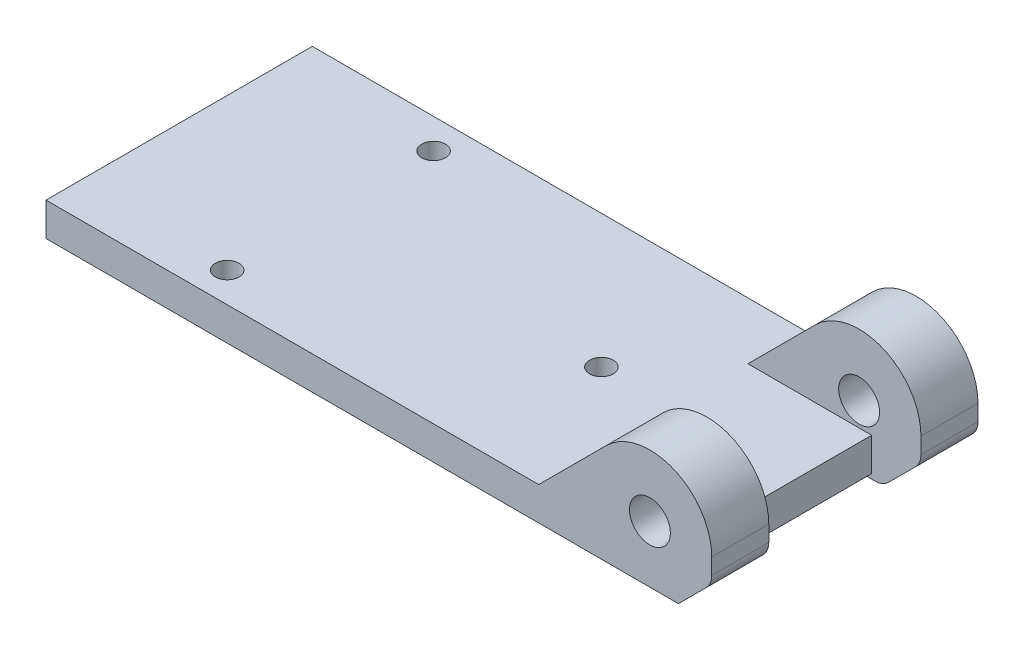
ISO-10303-21;
HEADER;
FILE_DESCRIPTION(('STEP AP214'),'2;1');
FILE_NAME('part.step','',(''),(''),'','','');
FILE_SCHEMA(('AUTOMOTIVE_DESIGN { 1 0 10303 214 1 1 1 1 }'));
ENDSEC;
DATA;
#1=APPLICATION_CONTEXT('core data for automotive mechanical design processes');
#2=APPLICATION_PROTOCOL_DEFINITION('international standard','automotive_design',2000,#1);
#3=PRODUCT_CONTEXT('',#1,'mechanical');
#4=PRODUCT('Part','Part','',(#3));
#5=PRODUCT_RELATED_PRODUCT_CATEGORY('part','',(#4));
#6=PRODUCT_DEFINITION_FORMATION('','',#4);
#7=PRODUCT_DEFINITION_CONTEXT('part definition',#1,'design');
#8=PRODUCT_DEFINITION('design','',#6,#7);
#9=PRODUCT_DEFINITION_SHAPE('','',#8);
#10=(LENGTH_UNIT() NAMED_UNIT(*) SI_UNIT(.MILLI.,.METRE.));
#11=(NAMED_UNIT(*) PLANE_ANGLE_UNIT() SI_UNIT($,.RADIAN.));
#12=(NAMED_UNIT(*) SI_UNIT($,.STERADIAN.) SOLID_ANGLE_UNIT());
#13=UNCERTAINTY_MEASURE_WITH_UNIT(LENGTH_MEASURE(1.E-05),#10,'distance_accuracy_value','');
#14=(GEOMETRIC_REPRESENTATION_CONTEXT(3) GLOBAL_UNCERTAINTY_ASSIGNED_CONTEXT((#13)) GLOBAL_UNIT_ASSIGNED_CONTEXT((#10,
#11,#12)) REPRESENTATION_CONTEXT('',''));
#15=CARTESIAN_POINT('',(0.,0.,0.));
#16=DIRECTION('',(0.,0.,1.));
#17=DIRECTION('',(1.,0.,0.));
#18=AXIS2_PLACEMENT_3D('',#15,#16,#17);
#19=CARTESIAN_POINT('',(35.,3.99999999999998,-14.));
#20=DIRECTION('',(0.707106781186546,-0.707106781186549,0.));
#21=DIRECTION('',(0.,0.,1.));
#22=AXIS2_PLACEMENT_3D('',#19,#20,#21);
#23=PLANE('',#22);
#24=DIRECTION('',(-0.707106781186549,-0.707106781186546,0.));
#25=VECTOR('',#24,1.);
#26=CARTESIAN_POINT('',(35.,3.99999999999998,8.));
#27=LINE('',#26,#25);
#28=CARTESIAN_POINT('',(34.4142135623731,3.41421356237307,8.));
#29=VERTEX_POINT('',#28);
#30=CARTESIAN_POINT('',(31.5857864376269,0.585786437626904,8.));
#31=VERTEX_POINT('',#30);
#32=EDGE_CURVE('E377',#29,#31,#27,.T.);
#33=ORIENTED_EDGE('',*,*,#32,.F.);
#34=DIRECTION('',(0.,0.,-1.));
#35=VECTOR('',#34,1.);
#36=CARTESIAN_POINT('',(34.4142135623731,3.41421356237307,14.));
#37=LINE('',#36,#35);
#38=CARTESIAN_POINT('',(34.4142135623731,3.41421356237307,14.));
#39=VERTEX_POINT('',#38);
#40=EDGE_CURVE('E300',#29,#39,#37,.F.);
#41=ORIENTED_EDGE('',*,*,#40,.T.);
#42=DIRECTION('',(0.707106781186549,0.707106781186546,0.));
#43=VECTOR('',#42,1.);
#44=CARTESIAN_POINT('',(35.,3.99999999999998,14.));
#45=LINE('',#44,#43);
#46=CARTESIAN_POINT('',(31.5857864376269,0.585786437626904,14.));
#47=VERTEX_POINT('',#46);
#48=EDGE_CURVE('E290',#47,#39,#45,.T.);
#49=ORIENTED_EDGE('',*,*,#48,.F.);
#50=DIRECTION('',(0.,0.,1.));
#51=VECTOR('',#50,1.);
#52=CARTESIAN_POINT('',(31.5857864376269,0.585786437626904,-14.));
#53=LINE('',#52,#51);
#54=EDGE_CURVE('E305',#47,#31,#53,.F.);
#55=ORIENTED_EDGE('',*,*,#54,.T.);
#56=EDGE_LOOP('',(#33,#41,#49,#55));
#57=FACE_BOUND('',#56,.T.);
#58=ADVANCED_FACE('F42',(#57),#23,.T.);
#59=CARTESIAN_POINT('',(30.1715728752538,2.,0.));
#60=DIRECTION('',(0.,0.,1.));
#61=DIRECTION('',(1.,0.,0.));
#62=AXIS2_PLACEMENT_3D('',#59,#60,#61);
#63=CYLINDRICAL_SURFACE('',#62,2.);
#64=CARTESIAN_POINT('',(30.1715728752538,2.,14.));
#65=DIRECTION('',(0.,0.,-1.));
#66=DIRECTION('',(-1.,0.,0.));
#67=AXIS2_PLACEMENT_3D('',#64,#65,#66);
#68=CIRCLE('',#67,2.);
#69=CARTESIAN_POINT('',(31.4944485307861,0.499999999999992,14.));
#70=VERTEX_POINT('',#69);
#71=EDGE_CURVE('E298',#70,#47,#68,.F.);
#72=ORIENTED_EDGE('',*,*,#71,.F.);
#73=CARTESIAN_POINT('',(30.1715728752538,2.,15.5));
#74=DIRECTION('',(0.,-0.707106781186552,0.707106781186543));
#75=DIRECTION('',(0.,0.707106781186543,0.707106781186552));
#76=AXIS2_PLACEMENT_3D('',#73,#74,#75);
#77=ELLIPSE('',#76,2.82842712474621,2.);
#78=CARTESIAN_POINT('',(30.1715728752538,0.,13.5));
#79=VERTEX_POINT('',#78);
#80=EDGE_CURVE('E340',#70,#79,#77,.F.);
#81=ORIENTED_EDGE('',*,*,#80,.T.);
#82=DIRECTION('',(0.,0.,1.));
#83=VECTOR('',#82,1.);
#84=CARTESIAN_POINT('',(30.1715728752538,0.,0.));
#85=LINE('',#84,#83);
#86=CARTESIAN_POINT('',(30.1715728752538,0.,8.));
#87=VERTEX_POINT('',#86);
#88=EDGE_CURVE('E293',#87,#79,#85,.T.);
#89=ORIENTED_EDGE('',*,*,#88,.F.);
#90=CARTESIAN_POINT('',(30.1715728752538,2.,8.));
#91=DIRECTION('',(0.,0.,1.));
#92=DIRECTION('',(1.,0.,0.));
#93=AXIS2_PLACEMENT_3D('',#90,#91,#92);
#94=CIRCLE('',#93,2.);
#95=EDGE_CURVE('E379',#31,#87,#94,.F.);
#96=ORIENTED_EDGE('',*,*,#95,.F.);
#97=ORIENTED_EDGE('',*,*,#54,.F.);
#98=EDGE_LOOP('',(#72,#81,#89,#96,#97));
#99=FACE_BOUND('',#98,.T.);
#100=ADVANCED_FACE('F405',(#99),#63,.T.);
#101=CARTESIAN_POINT('',(33.,4.82842712474617,-14.));
#102=DIRECTION('',(0.,0.,1.));
#103=DIRECTION('',(1.,0.,0.));
#104=AXIS2_PLACEMENT_3D('',#101,#102,#103);
#105=CYLINDRICAL_SURFACE('',#104,2.);
#106=ORIENTED_EDGE('',*,*,#40,.F.);
#107=CARTESIAN_POINT('',(33.,4.82842712474617,8.));
#108=DIRECTION('',(0.,0.,-1.));
#109=DIRECTION('',(-1.,0.,0.));
#110=AXIS2_PLACEMENT_3D('',#107,#108,#109);
#111=CIRCLE('',#110,2.);
#112=CARTESIAN_POINT('',(35.,4.82842712474617,8.));
#113=VERTEX_POINT('',#112);
#114=EDGE_CURVE('E321',#113,#29,#111,.T.);
#115=ORIENTED_EDGE('',*,*,#114,.F.);
#116=DIRECTION('',(0.,0.,-1.));
#117=VECTOR('',#116,1.);
#118=CARTESIAN_POINT('',(35.,4.82842712474617,8.));
#119=LINE('',#118,#117);
#120=CARTESIAN_POINT('',(35.,4.82842712474617,14.));
#121=VERTEX_POINT('',#120);
#122=EDGE_CURVE('E319',#121,#113,#119,.T.);
#123=ORIENTED_EDGE('',*,*,#122,.F.);
#124=CARTESIAN_POINT('',(33.,4.82842712474617,14.));
#125=DIRECTION('',(0.,0.,-1.));
#126=DIRECTION('',(-1.,0.,0.));
#127=AXIS2_PLACEMENT_3D('',#124,#125,#126);
#128=CIRCLE('',#127,2.);
#129=EDGE_CURVE('E296',#39,#121,#128,.F.);
#130=ORIENTED_EDGE('',*,*,#129,.F.);
#131=EDGE_LOOP('',(#106,#115,#123,#130));
#132=FACE_BOUND('',#131,.T.);
#133=ADVANCED_FACE('F410',(#132),#105,.T.);
#134=CARTESIAN_POINT('',(35.,4.,-14.));
#135=DIRECTION('',(-1.,0.,0.));
#136=DIRECTION('',(0.,0.,1.));
#137=AXIS2_PLACEMENT_3D('',#134,#135,#136);
#138=PLANE('',#137);
#139=DIRECTION('',(0.,-1.,0.));
#140=VECTOR('',#139,1.);
#141=CARTESIAN_POINT('',(35.,4.,14.));
#142=LINE('',#141,#140);
#143=CARTESIAN_POINT('',(35.,6.49999999999999,14.));
#144=VERTEX_POINT('',#143);
#145=EDGE_CURVE('E261',#144,#121,#142,.T.);
#146=ORIENTED_EDGE('',*,*,#145,.T.);
#147=ORIENTED_EDGE('',*,*,#122,.T.);
#148=DIRECTION('',(0.,1.,0.));
#149=VECTOR('',#148,1.);
#150=CARTESIAN_POINT('',(35.,13.,8.));
#151=LINE('',#150,#149);
#152=CARTESIAN_POINT('',(35.,6.5,8.));
#153=VERTEX_POINT('',#152);
#154=EDGE_CURVE('E240',#113,#153,#151,.T.);
#155=ORIENTED_EDGE('',*,*,#154,.T.);
#156=DIRECTION('',(0.,0.,-1.));
#157=VECTOR('',#156,1.);
#158=CARTESIAN_POINT('',(35.,6.50000000000002,14.));
#159=LINE('',#158,#157);
#160=EDGE_CURVE('E269',#153,#144,#159,.F.);
#161=ORIENTED_EDGE('',*,*,#160,.T.);
#162=EDGE_LOOP('',(#146,#147,#155,#161));
#163=FACE_BOUND('',#162,.T.);
#164=ADVANCED_FACE('F489',(#163),#138,.F.);
#165=CARTESIAN_POINT('',(28.5,6.50000000000002,-8.));
#166=DIRECTION('',(0.,0.,-1.));
#167=DIRECTION('',(-1.,0.,0.));
#168=AXIS2_PLACEMENT_3D('',#165,#166,#167);
#169=CYLINDRICAL_SURFACE('',#168,6.49999999999999);
#170=DIRECTION('',(0.,0.,-1.));
#171=VECTOR('',#170,1.);
#172=CARTESIAN_POINT('',(23.9038059222875,11.0961940777126,-8.));
#173=LINE('',#172,#171);
#174=CARTESIAN_POINT('',(23.9038059222875,11.0961940777126,-8.));
#175=VERTEX_POINT('',#174);
#176=CARTESIAN_POINT('',(23.9038059222875,11.0961940777126,-14.));
#177=VERTEX_POINT('',#176);
#178=EDGE_CURVE('E277',#175,#177,#173,.T.);
#179=ORIENTED_EDGE('',*,*,#178,.F.);
#180=CARTESIAN_POINT('',(28.5,6.50000000000002,-8.));
#181=DIRECTION('',(0.,0.,1.));
#182=DIRECTION('',(1.,0.,0.));
#183=AXIS2_PLACEMENT_3D('',#180,#181,#182);
#184=CIRCLE('',#183,6.49999999999999);
#185=CARTESIAN_POINT('',(35.,6.5,-8.));
#186=VERTEX_POINT('',#185);
#187=EDGE_CURVE('E283',#186,#175,#184,.T.);
#188=ORIENTED_EDGE('',*,*,#187,.F.);
#189=DIRECTION('',(0.,0.,-1.));
#190=VECTOR('',#189,1.);
#191=CARTESIAN_POINT('',(35.,6.50000000000002,-14.));
#192=LINE('',#191,#190);
#193=CARTESIAN_POINT('',(35.,6.49999999999999,-14.));
#194=VERTEX_POINT('',#193);
#195=EDGE_CURVE('E280',#194,#186,#192,.F.);
#196=ORIENTED_EDGE('',*,*,#195,.F.);
#197=CARTESIAN_POINT('',(28.5,6.50000000000002,-14.));
#198=DIRECTION('',(0.,0.,1.));
#199=DIRECTION('',(1.,0.,0.));
#200=AXIS2_PLACEMENT_3D('',#197,#198,#199);
#201=CIRCLE('',#200,6.49999999999999);
#202=EDGE_CURVE('E285',#177,#194,#201,.F.);
#203=ORIENTED_EDGE('',*,*,#202,.F.);
#204=EDGE_LOOP('',(#179,#188,#196,#203));
#205=FACE_BOUND('',#204,.T.);
#206=ADVANCED_FACE('F416',(#205),#169,.T.);
#207=CARTESIAN_POINT('',(28.5,6.50000000000002,14.));
#208=DIRECTION('',(0.,0.,1.));
#209=DIRECTION('',(1.,0.,0.));
#210=AXIS2_PLACEMENT_3D('',#207,#208,#209);
#211=CYLINDRICAL_SURFACE('',#210,6.49999999999999);
#212=DIRECTION('',(0.,0.,1.));
#213=VECTOR('',#212,1.);
#214=CARTESIAN_POINT('',(23.9038059222875,11.0961940777126,8.));
#215=LINE('',#214,#213);
#216=CARTESIAN_POINT('',(23.9038059222875,11.0961940777126,14.));
#217=VERTEX_POINT('',#216);
#218=CARTESIAN_POINT('',(23.9038059222875,11.0961940777126,8.));
#219=VERTEX_POINT('',#218);
#220=EDGE_CURVE('E266',#217,#219,#215,.F.);
#221=ORIENTED_EDGE('',*,*,#220,.F.);
#222=CARTESIAN_POINT('',(28.5,6.50000000000002,14.));
#223=DIRECTION('',(0.,0.,-1.));
#224=DIRECTION('',(-1.,0.,0.));
#225=AXIS2_PLACEMENT_3D('',#222,#223,#224);
#226=CIRCLE('',#225,6.49999999999999);
#227=EDGE_CURVE('E272',#144,#217,#226,.F.);
#228=ORIENTED_EDGE('',*,*,#227,.F.);
#229=ORIENTED_EDGE('',*,*,#160,.F.);
#230=CARTESIAN_POINT('',(28.5,6.50000000000002,8.));
#231=DIRECTION('',(0.,0.,-1.));
#232=DIRECTION('',(-1.,0.,0.));
#233=AXIS2_PLACEMENT_3D('',#230,#231,#232);
#234=CIRCLE('',#233,6.49999999999999);
#235=EDGE_CURVE('E274',#219,#153,#234,.T.);
#236=ORIENTED_EDGE('',*,*,#235,.F.);
#237=EDGE_LOOP('',(#221,#228,#229,#236));
#238=FACE_BOUND('',#237,.T.);
#239=ADVANCED_FACE('F486',(#238),#211,.T.);
#240=CARTESIAN_POINT('',(0.,4.,0.));
#241=DIRECTION('',(0.,-1.,0.));
#242=DIRECTION('',(0.,0.,-1.));
#243=AXIS2_PLACEMENT_3D('',#240,#241,#242);
#244=PLANE('',#243);
#245=CARTESIAN_POINT('',(9.40000000000002,4.,0.));
#246=DIRECTION('',(0.,1.,0.));
#247=DIRECTION('',(0.,0.,1.));
#248=AXIS2_PLACEMENT_3D('',#245,#246,#247);
#249=CIRCLE('',#248,1.25);
#250=CARTESIAN_POINT('',(9.40000000000002,4.,1.25));
#251=VERTEX_POINT('',#250);
#252=EDGE_CURVE('E367',#251,#251,#249,.T.);
#253=ORIENTED_EDGE('',*,*,#252,.F.);
#254=EDGE_LOOP('',(#253));
#255=FACE_BOUND('',#254,.T.);
#256=CARTESIAN_POINT('',(-19.1,4.,-10.8499999999998));
#257=DIRECTION('',(0.,1.,0.));
#258=DIRECTION('',(0.,0.,1.));
#259=AXIS2_PLACEMENT_3D('',#256,#257,#258);
#260=CIRCLE('',#259,1.25);
#261=CARTESIAN_POINT('',(-19.1,4.,-9.59999999999983));
#262=VERTEX_POINT('',#261);
#263=EDGE_CURVE('E353',#262,#262,#260,.T.);
#264=ORIENTED_EDGE('',*,*,#263,.F.);
#265=EDGE_LOOP('',(#264));
#266=FACE_BOUND('',#265,.T.);
#267=CARTESIAN_POINT('',(-19.1,4.,10.8499999999998));
#268=DIRECTION('',(0.,1.,0.));
#269=DIRECTION('',(0.,0.,1.));
#270=AXIS2_PLACEMENT_3D('',#267,#268,#269);
#271=CIRCLE('',#270,1.25);
#272=CARTESIAN_POINT('',(-19.1,4.,12.0999999999998));
#273=VERTEX_POINT('',#272);
#274=EDGE_CURVE('E213',#273,#273,#271,.T.);
#275=ORIENTED_EDGE('',*,*,#274,.F.);
#276=EDGE_LOOP('',(#275));
#277=FACE_BOUND('',#276,.T.);
#278=DIRECTION('',(1.,0.,0.));
#279=VECTOR('',#278,1.);
#280=CARTESIAN_POINT('',(16.8076118445749,4.,8.));
#281=LINE('',#280,#279);
#282=CARTESIAN_POINT('',(16.8076118445749,4.,8.));
#283=VERTEX_POINT('',#282);
#284=CARTESIAN_POINT('',(29.8203594422489,4.,8.));
#285=VERTEX_POINT('',#284);
#286=EDGE_CURVE('E211',#283,#285,#281,.T.);
#287=ORIENTED_EDGE('',*,*,#286,.T.);
#288=DIRECTION('',(0.,0.,1.));
#289=VECTOR('',#288,1.);
#290=CARTESIAN_POINT('',(29.8203594422489,4.,8.));
#291=LINE('',#290,#289);
#292=CARTESIAN_POINT('',(29.8203594422489,4.,-8.));
#293=VERTEX_POINT('',#292);
#294=EDGE_CURVE('E193',#293,#285,#291,.T.);
#295=ORIENTED_EDGE('',*,*,#294,.F.);
#296=DIRECTION('',(1.,0.,0.));
#297=VECTOR('',#296,1.);
#298=CARTESIAN_POINT('',(16.8076118445749,4.,-8.));
#299=LINE('',#298,#297);
#300=CARTESIAN_POINT('',(16.8076118445749,4.,-8.));
#301=VERTEX_POINT('',#300);
#302=EDGE_CURVE('E207',#301,#293,#299,.T.);
#303=ORIENTED_EDGE('',*,*,#302,.F.);
#304=DIRECTION('',(0.,0.,-1.));
#305=VECTOR('',#304,1.);
#306=CARTESIAN_POINT('',(16.8076118445749,4.,-8.));
#307=LINE('',#306,#305);
#308=CARTESIAN_POINT('',(16.8076118445749,4.,-14.));
#309=VERTEX_POINT('',#308);
#310=EDGE_CURVE('E229',#301,#309,#307,.T.);
#311=ORIENTED_EDGE('',*,*,#310,.T.);
#312=DIRECTION('',(-1.,0.,0.));
#313=VECTOR('',#312,1.);
#314=CARTESIAN_POINT('',(35.,4.,-14.));
#315=LINE('',#314,#313);
#316=CARTESIAN_POINT('',(-35.,4.,-14.));
#317=VERTEX_POINT('',#316);
#318=EDGE_CURVE('E254',#309,#317,#315,.T.);
#319=ORIENTED_EDGE('',*,*,#318,.T.);
#320=DIRECTION('',(0.,0.,1.));
#321=VECTOR('',#320,1.);
#322=CARTESIAN_POINT('',(-35.,4.,-14.));
#323=LINE('',#322,#321);
#324=CARTESIAN_POINT('',(-35.,4.,14.));
#325=VERTEX_POINT('',#324);
#326=EDGE_CURVE('E248',#317,#325,#323,.T.);
#327=ORIENTED_EDGE('',*,*,#326,.T.);
#328=DIRECTION('',(1.,0.,0.));
#329=VECTOR('',#328,1.);
#330=CARTESIAN_POINT('',(35.,4.,14.));
#331=LINE('',#330,#329);
#332=CARTESIAN_POINT('',(16.8076118445749,4.,14.));
#333=VERTEX_POINT('',#332);
#334=EDGE_CURVE('E251',#325,#333,#331,.T.);
#335=ORIENTED_EDGE('',*,*,#334,.T.);
#336=DIRECTION('',(0.,0.,1.));
#337=VECTOR('',#336,1.);
#338=CARTESIAN_POINT('',(16.8076118445749,4.,8.));
#339=LINE('',#338,#337);
#340=EDGE_CURVE('E244',#283,#333,#339,.T.);
#341=ORIENTED_EDGE('',*,*,#340,.F.);
#342=EDGE_LOOP('',(#287,#295,#303,#311,#319,#327,#335,#341));
#343=FACE_BOUND('',#342,.T.);
#344=ADVANCED_FACE('F205',(#255,#266,#277,#343),#244,.F.);
#345=CARTESIAN_POINT('',(-35.,4.,-14.));
#346=DIRECTION('',(1.,0.,0.));
#347=DIRECTION('',(0.,0.,-1.));
#348=AXIS2_PLACEMENT_3D('',#345,#346,#347);
#349=PLANE('',#348);
#350=DIRECTION('',(0.,-1.,0.));
#351=VECTOR('',#350,1.);
#352=CARTESIAN_POINT('',(-35.,4.,-14.));
#353=LINE('',#352,#351);
#354=CARTESIAN_POINT('',(-35.,0.499999999999994,-14.));
#355=VERTEX_POINT('',#354);
#356=EDGE_CURVE('E256',#317,#355,#353,.T.);
#357=ORIENTED_EDGE('',*,*,#356,.T.);
#358=DIRECTION('',(0.,0.,1.));
#359=VECTOR('',#358,1.);
#360=CARTESIAN_POINT('',(-35.,0.499999999999994,14.));
#361=LINE('',#360,#359);
#362=CARTESIAN_POINT('',(-35.,0.499999999999994,14.));
#363=VERTEX_POINT('',#362);
#364=EDGE_CURVE('E67',#355,#363,#361,.T.);
#365=ORIENTED_EDGE('',*,*,#364,.T.);
#366=DIRECTION('',(0.,-1.,0.));
#367=VECTOR('',#366,1.);
#368=CARTESIAN_POINT('',(-35.,4.,14.));
#369=LINE('',#368,#367);
#370=EDGE_CURVE('E264',#325,#363,#369,.T.);
#371=ORIENTED_EDGE('',*,*,#370,.F.);
#372=ORIENTED_EDGE('',*,*,#326,.F.);
#373=EDGE_LOOP('',(#357,#365,#371,#372));
#374=FACE_BOUND('',#373,.T.);
#375=ADVANCED_FACE('F475',(#374),#349,.F.);
#376=CARTESIAN_POINT('',(35.,4.,14.));
#377=DIRECTION('',(0.,0.,-1.));
#378=DIRECTION('',(-1.,0.,0.));
#379=AXIS2_PLACEMENT_3D('',#376,#377,#378);
#380=PLANE('',#379);
#381=ORIENTED_EDGE('',*,*,#370,.T.);
#382=DIRECTION('',(1.,0.,0.));
#383=VECTOR('',#382,1.);
#384=CARTESIAN_POINT('',(30.1715728752538,0.499999999999994,14.));
#385=LINE('',#384,#383);
#386=EDGE_CURVE('E59',#363,#70,#385,.T.);
#387=ORIENTED_EDGE('',*,*,#386,.T.);
#388=ORIENTED_EDGE('',*,*,#71,.T.);
#389=ORIENTED_EDGE('',*,*,#48,.T.);
#390=ORIENTED_EDGE('',*,*,#129,.T.);
#391=ORIENTED_EDGE('',*,*,#145,.F.);
#392=ORIENTED_EDGE('',*,*,#227,.T.);
#393=DIRECTION('',(-0.707106781186546,-0.707106781186549,0.));
#394=VECTOR('',#393,1.);
#395=CARTESIAN_POINT('',(16.8076118445749,4.,14.));
#396=LINE('',#395,#394);
#397=EDGE_CURVE('E236',#217,#333,#396,.T.);
#398=ORIENTED_EDGE('',*,*,#397,.T.);
#399=ORIENTED_EDGE('',*,*,#334,.F.);
#400=EDGE_LOOP('',(#381,#387,#388,#389,#390,#391,#392,#398,#399));
#401=FACE_BOUND('',#400,.T.);
#402=CARTESIAN_POINT('',(28.5,6.5,14.));
#403=DIRECTION('',(0.,0.,1.));
#404=DIRECTION('',(1.,0.,0.));
#405=AXIS2_PLACEMENT_3D('',#402,#403,#404);
#406=CIRCLE('',#405,2.15);
#407=CARTESIAN_POINT('',(30.65,6.5,14.));
#408=VERTEX_POINT('',#407);
#409=EDGE_CURVE('E232',#408,#408,#406,.T.);
#410=ORIENTED_EDGE('',*,*,#409,.F.);
#411=EDGE_LOOP('',(#410));
#412=FACE_BOUND('',#411,.T.);
#413=ADVANCED_FACE('F476',(#401,#412),#380,.F.);
#414=DIRECTION('',(0.,1.,0.));
#415=VECTOR('',#414,1.);
#416=CARTESIAN_POINT('',(35.,13.,-8.));
#417=LINE('',#416,#415);
#418=CARTESIAN_POINT('',(35.,4.82842712474617,-8.));
#419=VERTEX_POINT('',#418);
#420=EDGE_CURVE('E221',#419,#186,#417,.T.);
#421=ORIENTED_EDGE('',*,*,#420,.F.);
#422=DIRECTION('',(0.,0.,-1.));
#423=VECTOR('',#422,1.);
#424=CARTESIAN_POINT('',(35.,4.82842712474617,-14.));
#425=LINE('',#424,#423);
#426=CARTESIAN_POINT('',(35.,4.82842712474617,-14.));
#427=VERTEX_POINT('',#426);
#428=EDGE_CURVE('E314',#419,#427,#425,.T.);
#429=ORIENTED_EDGE('',*,*,#428,.T.);
#430=DIRECTION('',(0.,-1.,0.));
#431=VECTOR('',#430,1.);
#432=CARTESIAN_POINT('',(35.,4.,-14.));
#433=LINE('',#432,#431);
#434=EDGE_CURVE('E258',#194,#427,#433,.T.);
#435=ORIENTED_EDGE('',*,*,#434,.F.);
#436=ORIENTED_EDGE('',*,*,#195,.T.);
#437=EDGE_LOOP('',(#421,#429,#435,#436));
#438=FACE_BOUND('',#437,.T.);
#439=ADVANCED_FACE('F466',(#438),#138,.F.);
#440=CARTESIAN_POINT('',(35.,4.,-14.));
#441=DIRECTION('',(0.,0.,1.));
#442=DIRECTION('',(1.,0.,0.));
#443=AXIS2_PLACEMENT_3D('',#440,#441,#442);
#444=PLANE('',#443);
#445=CARTESIAN_POINT('',(30.1715728752538,2.,-14.));
#446=DIRECTION('',(0.,0.,1.));
#447=DIRECTION('',(1.,0.,0.));
#448=AXIS2_PLACEMENT_3D('',#445,#446,#447);
#449=CIRCLE('',#448,2.);
#450=CARTESIAN_POINT('',(31.5857864376269,0.585786437626904,-14.));
#451=VERTEX_POINT('',#450);
#452=CARTESIAN_POINT('',(31.4944485307861,0.499999999999992,-14.));
#453=VERTEX_POINT('',#452);
#454=EDGE_CURVE('E311',#451,#453,#449,.F.);
#455=ORIENTED_EDGE('',*,*,#454,.T.);
#456=DIRECTION('',(-1.,0.,0.));
#457=VECTOR('',#456,1.);
#458=CARTESIAN_POINT('',(-35.,0.499999999999994,-14.));
#459=LINE('',#458,#457);
#460=EDGE_CURVE('E333',#453,#355,#459,.T.);
#461=ORIENTED_EDGE('',*,*,#460,.T.);
#462=ORIENTED_EDGE('',*,*,#356,.F.);
#463=ORIENTED_EDGE('',*,*,#318,.F.);
#464=DIRECTION('',(-0.707106781186546,-0.707106781186549,0.));
#465=VECTOR('',#464,1.);
#466=CARTESIAN_POINT('',(16.8076118445749,4.,-14.));
#467=LINE('',#466,#465);
#468=EDGE_CURVE('E219',#177,#309,#467,.T.);
#469=ORIENTED_EDGE('',*,*,#468,.F.);
#470=ORIENTED_EDGE('',*,*,#202,.T.);
#471=ORIENTED_EDGE('',*,*,#434,.T.);
#472=CARTESIAN_POINT('',(33.,4.82842712474617,-14.));
#473=DIRECTION('',(0.,0.,1.));
#474=DIRECTION('',(1.,0.,0.));
#475=AXIS2_PLACEMENT_3D('',#472,#473,#474);
#476=CIRCLE('',#475,2.);
#477=CARTESIAN_POINT('',(34.4142135623731,3.41421356237307,-14.));
#478=VERTEX_POINT('',#477);
#479=EDGE_CURVE('E308',#427,#478,#476,.F.);
#480=ORIENTED_EDGE('',*,*,#479,.T.);
#481=DIRECTION('',(-0.707106781186549,-0.707106781186546,0.));
#482=VECTOR('',#481,1.);
#483=CARTESIAN_POINT('',(35.,3.99999999999998,-14.));
#484=LINE('',#483,#482);
#485=EDGE_CURVE('E287',#478,#451,#484,.T.);
#486=ORIENTED_EDGE('',*,*,#485,.T.);
#487=EDGE_LOOP('',(#455,#461,#462,#463,#469,#470,#471,#480,#486));
#488=FACE_BOUND('',#487,.T.);
#489=CARTESIAN_POINT('',(28.5,6.5,-14.));
#490=DIRECTION('',(0.,0.,1.));
#491=DIRECTION('',(1.,0.,0.));
#492=AXIS2_PLACEMENT_3D('',#489,#490,#491);
#493=CIRCLE('',#492,2.15);
#494=CARTESIAN_POINT('',(30.65,6.5,-14.));
#495=VERTEX_POINT('',#494);
#496=EDGE_CURVE('E226',#495,#495,#493,.T.);
#497=ORIENTED_EDGE('',*,*,#496,.T.);
#498=EDGE_LOOP('',(#497));
#499=FACE_BOUND('',#498,.T.);
#500=ADVANCED_FACE('F386',(#488,#499),#444,.F.);
#501=CARTESIAN_POINT('',(0.,0.,0.));
#502=DIRECTION('',(0.,-1.,0.));
#503=DIRECTION('',(0.,0.,-1.));
#504=AXIS2_PLACEMENT_3D('',#501,#502,#503);
#505=PLANE('',#504);
#506=CARTESIAN_POINT('',(9.40000000000002,0.,0.));
#507=DIRECTION('',(0.,-1.,0.));
#508=DIRECTION('',(0.,0.,-1.));
#509=AXIS2_PLACEMENT_3D('',#506,#507,#508);
#510=CIRCLE('',#509,1.25);
#511=CARTESIAN_POINT('',(9.40000000000002,0.,-1.25));
#512=VERTEX_POINT('',#511);
#513=EDGE_CURVE('E358',#512,#512,#510,.F.);
#514=ORIENTED_EDGE('',*,*,#513,.T.);
#515=EDGE_LOOP('',(#514));
#516=FACE_BOUND('',#515,.T.);
#517=CARTESIAN_POINT('',(-19.1,0.,-10.8499999999998));
#518=DIRECTION('',(0.,-1.,0.));
#519=DIRECTION('',(0.,0.,-1.));
#520=AXIS2_PLACEMENT_3D('',#517,#518,#519);
#521=CIRCLE('',#520,1.25);
#522=CARTESIAN_POINT('',(-19.1,0.,-12.0999999999998));
#523=VERTEX_POINT('',#522);
#524=EDGE_CURVE('E348',#523,#523,#521,.F.);
#525=ORIENTED_EDGE('',*,*,#524,.T.);
#526=EDGE_LOOP('',(#525));
#527=FACE_BOUND('',#526,.T.);
#528=CARTESIAN_POINT('',(-19.1,0.,10.8499999999998));
#529=DIRECTION('',(0.,-1.,0.));
#530=DIRECTION('',(0.,0.,-1.));
#531=AXIS2_PLACEMENT_3D('',#528,#529,#530);
#532=CIRCLE('',#531,1.25);
#533=CARTESIAN_POINT('',(-19.1,0.,9.59999999999983));
#534=VERTEX_POINT('',#533);
#535=EDGE_CURVE('E364',#534,#534,#532,.F.);
#536=ORIENTED_EDGE('',*,*,#535,.T.);
#537=EDGE_LOOP('',(#536));
#538=FACE_BOUND('',#537,.T.);
#539=DIRECTION('',(0.,0.,1.));
#540=VECTOR('',#539,1.);
#541=CARTESIAN_POINT('',(29.3203594422489,0.,8.));
#542=LINE('',#541,#540);
#543=CARTESIAN_POINT('',(29.3203594422489,0.,-8.));
#544=VERTEX_POINT('',#543);
#545=CARTESIAN_POINT('',(29.3203594422489,0.,8.));
#546=VERTEX_POINT('',#545);
#547=EDGE_CURVE('E329',#544,#546,#542,.T.);
#548=ORIENTED_EDGE('',*,*,#547,.T.);
#549=DIRECTION('',(1.,0.,0.));
#550=VECTOR('',#549,1.);
#551=CARTESIAN_POINT('',(34.8203594422489,0.,8.));
#552=LINE('',#551,#550);
#553=EDGE_CURVE('E201',#546,#87,#552,.T.);
#554=ORIENTED_EDGE('',*,*,#553,.T.);
#555=ORIENTED_EDGE('',*,*,#88,.T.);
#556=DIRECTION('',(-1.,0.,0.));
#557=VECTOR('',#556,1.);
#558=CARTESIAN_POINT('',(-35.,0.,13.5));
#559=LINE('',#558,#557);
#560=CARTESIAN_POINT('',(-34.5,0.,13.5));
#561=VERTEX_POINT('',#560);
#562=EDGE_CURVE('E323',#79,#561,#559,.T.);
#563=ORIENTED_EDGE('',*,*,#562,.T.);
#564=DIRECTION('',(0.,0.,-1.));
#565=VECTOR('',#564,1.);
#566=CARTESIAN_POINT('',(-34.5,0.,-14.));
#567=LINE('',#566,#565);
#568=CARTESIAN_POINT('',(-34.5,0.,-13.5));
#569=VERTEX_POINT('',#568);
#570=EDGE_CURVE('E325',#561,#569,#567,.T.);
#571=ORIENTED_EDGE('',*,*,#570,.T.);
#572=DIRECTION('',(1.,0.,0.));
#573=VECTOR('',#572,1.);
#574=CARTESIAN_POINT('',(30.1715728752538,0.,-13.5));
#575=LINE('',#574,#573);
#576=CARTESIAN_POINT('',(30.1715728752538,0.,-13.5));
#577=VERTEX_POINT('',#576);
#578=EDGE_CURVE('E327',#569,#577,#575,.T.);
#579=ORIENTED_EDGE('',*,*,#578,.T.);
#580=CARTESIAN_POINT('',(30.1715728752538,0.,-8.));
#581=VERTEX_POINT('',#580);
#582=EDGE_CURVE('E294',#577,#581,#85,.T.);
#583=ORIENTED_EDGE('',*,*,#582,.T.);
#584=DIRECTION('',(-1.,0.,0.));
#585=VECTOR('',#584,1.);
#586=CARTESIAN_POINT('',(34.8203594422489,0.,-8.));
#587=LINE('',#586,#585);
#588=EDGE_CURVE('E212',#581,#544,#587,.T.);
#589=ORIENTED_EDGE('',*,*,#588,.T.);
#590=EDGE_LOOP('',(#548,#554,#555,#563,#571,#579,#583,#589));
#591=FACE_BOUND('',#590,.T.);
#592=ADVANCED_FACE('F447',(#516,#527,#538,#591),#505,.T.);
#593=CARTESIAN_POINT('',(16.8076118445749,4.,8.));
#594=DIRECTION('',(-0.707106781186549,0.707106781186546,0.));
#595=DIRECTION('',(-0.707106781186546,-0.707106781186549,0.));
#596=AXIS2_PLACEMENT_3D('',#593,#594,#595);
#597=PLANE('',#596);
#598=ORIENTED_EDGE('',*,*,#397,.F.);
#599=ORIENTED_EDGE('',*,*,#220,.T.);
#600=DIRECTION('',(-0.707106781186546,-0.707106781186549,0.));
#601=VECTOR('',#600,1.);
#602=CARTESIAN_POINT('',(16.8076118445749,4.,8.));
#603=LINE('',#602,#601);
#604=EDGE_CURVE('E242',#219,#283,#603,.T.);
#605=ORIENTED_EDGE('',*,*,#604,.T.);
#606=ORIENTED_EDGE('',*,*,#340,.T.);
#607=EDGE_LOOP('',(#598,#599,#605,#606));
#608=FACE_BOUND('',#607,.T.);
#609=ADVANCED_FACE('F480',(#608),#597,.T.);
#610=CARTESIAN_POINT('',(0.,0.,8.));
#611=DIRECTION('',(0.,0.,-1.));
#612=DIRECTION('',(-1.,0.,0.));
#613=AXIS2_PLACEMENT_3D('',#610,#611,#612);
#614=PLANE('',#613);
#615=CARTESIAN_POINT('',(28.5,6.5,8.));
#616=DIRECTION('',(0.,0.,1.));
#617=DIRECTION('',(1.,0.,0.));
#618=AXIS2_PLACEMENT_3D('',#615,#616,#617);
#619=CIRCLE('',#618,2.15);
#620=CARTESIAN_POINT('',(30.65,6.5,8.));
#621=VERTEX_POINT('',#620);
#622=EDGE_CURVE('E233',#621,#621,#619,.T.);
#623=ORIENTED_EDGE('',*,*,#622,.T.);
#624=EDGE_LOOP('',(#623));
#625=FACE_BOUND('',#624,.T.);
#626=ORIENTED_EDGE('',*,*,#154,.F.);
#627=ORIENTED_EDGE('',*,*,#114,.T.);
#628=ORIENTED_EDGE('',*,*,#32,.T.);
#629=ORIENTED_EDGE('',*,*,#95,.T.);
#630=ORIENTED_EDGE('',*,*,#553,.F.);
#631=DIRECTION('',(0.707106781186543,0.707106781186552,0.));
#632=VECTOR('',#631,1.);
#633=CARTESIAN_POINT('',(29.3203594422489,0.,8.));
#634=LINE('',#633,#632);
#635=CARTESIAN_POINT('',(29.8203594422489,0.499999999999994,8.));
#636=VERTEX_POINT('',#635);
#637=EDGE_CURVE('E51',#546,#636,#634,.T.);
#638=ORIENTED_EDGE('',*,*,#637,.T.);
#639=DIRECTION('',(0.,1.,0.));
#640=VECTOR('',#639,1.);
#641=CARTESIAN_POINT('',(29.8203594422489,0.,8.));
#642=LINE('',#641,#640);
#643=EDGE_CURVE('E200',#636,#285,#642,.T.);
#644=ORIENTED_EDGE('',*,*,#643,.T.);
#645=ORIENTED_EDGE('',*,*,#286,.F.);
#646=ORIENTED_EDGE('',*,*,#604,.F.);
#647=ORIENTED_EDGE('',*,*,#235,.T.);
#648=EDGE_LOOP('',(#626,#627,#628,#629,#630,#638,#644,#645,#646,#647));
#649=FACE_BOUND('',#648,.T.);
#650=ADVANCED_FACE('F452',(#625,#649),#614,.T.);
#651=CARTESIAN_POINT('',(28.5,6.5,8.));
#652=DIRECTION('',(0.,0.,1.));
#653=DIRECTION('',(1.,0.,0.));
#654=AXIS2_PLACEMENT_3D('',#651,#652,#653);
#655=CYLINDRICAL_SURFACE('',#654,2.15);
#656=ORIENTED_EDGE('',*,*,#622,.F.);
#657=EDGE_LOOP('',(#656));
#658=FACE_BOUND('',#657,.T.);
#659=ORIENTED_EDGE('',*,*,#409,.T.);
#660=EDGE_LOOP('',(#659));
#661=FACE_BOUND('',#660,.T.);
#662=ADVANCED_FACE('F606',(#658,#661),#655,.F.);
#663=CARTESIAN_POINT('',(0.,0.,-8.));
#664=DIRECTION('',(0.,0.,1.));
#665=DIRECTION('',(-1.,0.,0.));
#666=AXIS2_PLACEMENT_3D('',#663,#664,#665);
#667=PLANE('',#666);
#668=ORIENTED_EDGE('',*,*,#302,.T.);
#669=DIRECTION('',(0.,1.,0.));
#670=VECTOR('',#669,1.);
#671=CARTESIAN_POINT('',(29.8203594422489,0.,-8.));
#672=LINE('',#671,#670);
#673=CARTESIAN_POINT('',(29.8203594422489,0.499999999999994,-8.));
#674=VERTEX_POINT('',#673);
#675=EDGE_CURVE('E189',#674,#293,#672,.T.);
#676=ORIENTED_EDGE('',*,*,#675,.F.);
#677=DIRECTION('',(-0.707106781186543,-0.707106781186552,0.));
#678=VECTOR('',#677,1.);
#679=CARTESIAN_POINT('',(29.3203594422489,0.,-8.));
#680=LINE('',#679,#678);
#681=EDGE_CURVE('E12',#674,#544,#680,.T.);
#682=ORIENTED_EDGE('',*,*,#681,.T.);
#683=ORIENTED_EDGE('',*,*,#588,.F.);
#684=CARTESIAN_POINT('',(30.1715728752538,2.,-8.));
#685=DIRECTION('',(0.,0.,-1.));
#686=DIRECTION('',(-1.,0.,0.));
#687=AXIS2_PLACEMENT_3D('',#684,#685,#686);
#688=CIRCLE('',#687,2.);
#689=CARTESIAN_POINT('',(31.5857864376269,0.585786437626904,-8.));
#690=VERTEX_POINT('',#689);
#691=EDGE_CURVE('E375',#581,#690,#688,.F.);
#692=ORIENTED_EDGE('',*,*,#691,.T.);
#693=DIRECTION('',(0.707106781186549,0.707106781186546,0.));
#694=VECTOR('',#693,1.);
#695=CARTESIAN_POINT('',(35.,3.99999999999998,-8.));
#696=LINE('',#695,#694);
#697=CARTESIAN_POINT('',(34.4142135623731,3.41421356237307,-8.));
#698=VERTEX_POINT('',#697);
#699=EDGE_CURVE('E371',#690,#698,#696,.T.);
#700=ORIENTED_EDGE('',*,*,#699,.T.);
#701=CARTESIAN_POINT('',(33.,4.82842712474617,-8.));
#702=DIRECTION('',(0.,0.,1.));
#703=DIRECTION('',(1.,0.,0.));
#704=AXIS2_PLACEMENT_3D('',#701,#702,#703);
#705=CIRCLE('',#704,2.);
#706=EDGE_CURVE('E317',#698,#419,#705,.T.);
#707=ORIENTED_EDGE('',*,*,#706,.T.);
#708=ORIENTED_EDGE('',*,*,#420,.T.);
#709=ORIENTED_EDGE('',*,*,#187,.T.);
#710=DIRECTION('',(-0.707106781186546,-0.707106781186549,0.));
#711=VECTOR('',#710,1.);
#712=CARTESIAN_POINT('',(16.8076118445749,4.,-8.));
#713=LINE('',#712,#711);
#714=EDGE_CURVE('E218',#175,#301,#713,.T.);
#715=ORIENTED_EDGE('',*,*,#714,.T.);
#716=EDGE_LOOP('',(#668,#676,#682,#683,#692,#700,#707,#708,#709,#715));
#717=FACE_BOUND('',#716,.T.);
#718=CARTESIAN_POINT('',(28.5,6.5,-8.));
#719=DIRECTION('',(0.,0.,1.));
#720=DIRECTION('',(1.,0.,0.));
#721=AXIS2_PLACEMENT_3D('',#718,#719,#720);
#722=CIRCLE('',#721,2.15);
#723=CARTESIAN_POINT('',(30.65,6.5,-8.));
#724=VERTEX_POINT('',#723);
#725=EDGE_CURVE('E223',#724,#724,#722,.T.);
#726=ORIENTED_EDGE('',*,*,#725,.F.);
#727=EDGE_LOOP('',(#726));
#728=FACE_BOUND('',#727,.T.);
#729=ADVANCED_FACE('F215',(#717,#728),#667,.T.);
#730=CARTESIAN_POINT('',(16.8076118445749,4.,-8.));
#731=DIRECTION('',(0.707106781186549,-0.707106781186546,0.));
#732=DIRECTION('',(0.707106781186546,0.707106781186549,0.));
#733=AXIS2_PLACEMENT_3D('',#730,#731,#732);
#734=PLANE('',#733);
#735=ORIENTED_EDGE('',*,*,#714,.F.);
#736=ORIENTED_EDGE('',*,*,#178,.T.);
#737=ORIENTED_EDGE('',*,*,#468,.T.);
#738=ORIENTED_EDGE('',*,*,#310,.F.);
#739=EDGE_LOOP('',(#735,#736,#737,#738));
#740=FACE_BOUND('',#739,.T.);
#741=ADVANCED_FACE('F391',(#740),#734,.F.);
#742=CARTESIAN_POINT('',(28.5,6.5,-8.));
#743=DIRECTION('',(0.,0.,-1.));
#744=DIRECTION('',(-1.,0.,0.));
#745=AXIS2_PLACEMENT_3D('',#742,#743,#744);
#746=CYLINDRICAL_SURFACE('',#745,2.15);
#747=ORIENTED_EDGE('',*,*,#725,.T.);
#748=EDGE_LOOP('',(#747));
#749=FACE_BOUND('',#748,.T.);
#750=ORIENTED_EDGE('',*,*,#496,.F.);
#751=EDGE_LOOP('',(#750));
#752=FACE_BOUND('',#751,.T.);
#753=ADVANCED_FACE('F388',(#749,#752),#746,.F.);
#754=ORIENTED_EDGE('',*,*,#699,.F.);
#755=EDGE_CURVE('E304',#690,#451,#53,.F.);
#756=ORIENTED_EDGE('',*,*,#755,.T.);
#757=ORIENTED_EDGE('',*,*,#485,.F.);
#758=EDGE_CURVE('E301',#478,#698,#37,.F.);
#759=ORIENTED_EDGE('',*,*,#758,.T.);
#760=EDGE_LOOP('',(#754,#756,#757,#759));
#761=FACE_BOUND('',#760,.T.);
#762=ADVANCED_FACE('F390',(#761),#23,.T.);
#763=ORIENTED_EDGE('',*,*,#582,.F.);
#764=CARTESIAN_POINT('',(30.1715728752538,2.,-15.5));
#765=DIRECTION('',(0.,-0.707106781186553,-0.707106781186542));
#766=DIRECTION('',(0.,-0.707106781186542,0.707106781186553));
#767=AXIS2_PLACEMENT_3D('',#764,#765,#766);
#768=ELLIPSE('',#767,2.82842712474621,2.);
#769=EDGE_CURVE('E336',#577,#453,#768,.F.);
#770=ORIENTED_EDGE('',*,*,#769,.T.);
#771=ORIENTED_EDGE('',*,*,#454,.F.);
#772=ORIENTED_EDGE('',*,*,#755,.F.);
#773=ORIENTED_EDGE('',*,*,#691,.F.);
#774=EDGE_LOOP('',(#763,#770,#771,#772,#773));
#775=FACE_BOUND('',#774,.T.);
#776=ADVANCED_FACE('F397',(#775),#63,.T.);
#777=ORIENTED_EDGE('',*,*,#706,.F.);
#778=ORIENTED_EDGE('',*,*,#758,.F.);
#779=ORIENTED_EDGE('',*,*,#479,.F.);
#780=ORIENTED_EDGE('',*,*,#428,.F.);
#781=EDGE_LOOP('',(#777,#778,#779,#780));
#782=FACE_BOUND('',#781,.T.);
#783=ADVANCED_FACE('F420',(#782),#105,.T.);
#784=CARTESIAN_POINT('',(29.8203594422489,0.,8.));
#785=DIRECTION('',(-1.,0.,0.));
#786=DIRECTION('',(0.,0.,1.));
#787=AXIS2_PLACEMENT_3D('',#784,#785,#786);
#788=PLANE('',#787);
#789=ORIENTED_EDGE('',*,*,#643,.F.);
#790=DIRECTION('',(0.,0.,-1.));
#791=VECTOR('',#790,1.);
#792=CARTESIAN_POINT('',(29.8203594422489,0.499999999999994,-8.));
#793=LINE('',#792,#791);
#794=EDGE_CURVE('E196',#636,#674,#793,.T.);
#795=ORIENTED_EDGE('',*,*,#794,.T.);
#796=ORIENTED_EDGE('',*,*,#675,.T.);
#797=ORIENTED_EDGE('',*,*,#294,.T.);
#798=EDGE_LOOP('',(#789,#795,#796,#797));
#799=FACE_BOUND('',#798,.T.);
#800=ADVANCED_FACE('F192',(#799),#788,.F.);
#801=CARTESIAN_POINT('',(-19.1,-0.00100000000000013,10.8499999999998));
#802=DIRECTION('',(0.,1.,0.));
#803=DIRECTION('',(0.,0.,1.));
#804=AXIS2_PLACEMENT_3D('',#801,#802,#803);
#805=CYLINDRICAL_SURFACE('',#804,1.25);
#806=ORIENTED_EDGE('',*,*,#535,.F.);
#807=EDGE_LOOP('',(#806));
#808=FACE_BOUND('',#807,.T.);
#809=ORIENTED_EDGE('',*,*,#274,.T.);
#810=EDGE_LOOP('',(#809));
#811=FACE_BOUND('',#810,.T.);
#812=ADVANCED_FACE('F540',(#808,#811),#805,.F.);
#813=CARTESIAN_POINT('',(-19.1,-0.00100000000000013,-10.8499999999998));
#814=DIRECTION('',(0.,1.,0.));
#815=DIRECTION('',(0.,0.,1.));
#816=AXIS2_PLACEMENT_3D('',#813,#814,#815);
#817=CYLINDRICAL_SURFACE('',#816,1.25);
#818=ORIENTED_EDGE('',*,*,#524,.F.);
#819=EDGE_LOOP('',(#818));
#820=FACE_BOUND('',#819,.T.);
#821=ORIENTED_EDGE('',*,*,#263,.T.);
#822=EDGE_LOOP('',(#821));
#823=FACE_BOUND('',#822,.T.);
#824=ADVANCED_FACE('F543',(#820,#823),#817,.F.);
#825=CARTESIAN_POINT('',(9.40000000000002,-0.00100000000000013,0.));
#826=DIRECTION('',(0.,1.,0.));
#827=DIRECTION('',(0.,0.,1.));
#828=AXIS2_PLACEMENT_3D('',#825,#826,#827);
#829=CYLINDRICAL_SURFACE('',#828,1.25);
#830=ORIENTED_EDGE('',*,*,#513,.F.);
#831=EDGE_LOOP('',(#830));
#832=FACE_BOUND('',#831,.T.);
#833=ORIENTED_EDGE('',*,*,#252,.T.);
#834=EDGE_LOOP('',(#833));
#835=FACE_BOUND('',#834,.T.);
#836=ADVANCED_FACE('F428',(#832,#835),#829,.F.);
#837=CARTESIAN_POINT('',(29.3203594422489,0.,0.));
#838=DIRECTION('',(0.707106781186552,-0.707106781186543,0.));
#839=DIRECTION('',(0.,0.,-1.));
#840=AXIS2_PLACEMENT_3D('',#837,#838,#839);
#841=PLANE('',#840);
#842=ORIENTED_EDGE('',*,*,#681,.F.);
#843=ORIENTED_EDGE('',*,*,#794,.F.);
#844=ORIENTED_EDGE('',*,*,#637,.F.);
#845=ORIENTED_EDGE('',*,*,#547,.F.);
#846=EDGE_LOOP('',(#842,#843,#844,#845));
#847=FACE_BOUND('',#846,.T.);
#848=ADVANCED_FACE('F425',(#847),#841,.T.);
#849=CARTESIAN_POINT('',(35.,0.499999999999994,14.));
#850=DIRECTION('',(0.,-0.707106781186552,0.707106781186543));
#851=DIRECTION('',(-1.,0.,0.));
#852=AXIS2_PLACEMENT_3D('',#849,#850,#851);
#853=PLANE('',#852);
#854=ORIENTED_EDGE('',*,*,#80,.F.);
#855=ORIENTED_EDGE('',*,*,#386,.F.);
#856=DIRECTION('',(0.577350269189628,-0.57735026918962,-0.577350269189629));
#857=VECTOR('',#856,1.);
#858=CARTESIAN_POINT('',(-11.6666666666664,-22.8333333333332,-9.33333333333355));
#859=LINE('',#858,#857);
#860=EDGE_CURVE('E46',#561,#363,#859,.F.);
#861=ORIENTED_EDGE('',*,*,#860,.F.);
#862=ORIENTED_EDGE('',*,*,#562,.F.);
#863=EDGE_LOOP('',(#854,#855,#861,#862));
#864=FACE_BOUND('',#863,.T.);
#865=ADVANCED_FACE('F44',(#864),#853,.T.);
#866=CARTESIAN_POINT('',(-35.,0.499999999999994,-14.));
#867=DIRECTION('',(-0.707106781186543,-0.707106781186552,0.));
#868=DIRECTION('',(0.,0.,-1.));
#869=AXIS2_PLACEMENT_3D('',#866,#867,#868);
#870=PLANE('',#869);
#871=ORIENTED_EDGE('',*,*,#860,.T.);
#872=ORIENTED_EDGE('',*,*,#364,.F.);
#873=DIRECTION('',(0.577350269189628,-0.57735026918962,0.577350269189629));
#874=VECTOR('',#873,1.);
#875=CARTESIAN_POINT('',(-35.,0.499999999999994,-14.));
#876=LINE('',#875,#874);
#877=EDGE_CURVE('E342',#569,#355,#876,.F.);
#878=ORIENTED_EDGE('',*,*,#877,.F.);
#879=ORIENTED_EDGE('',*,*,#570,.F.);
#880=EDGE_LOOP('',(#871,#872,#878,#879));
#881=FACE_BOUND('',#880,.T.);
#882=ADVANCED_FACE('F432',(#881),#870,.T.);
#883=CARTESIAN_POINT('',(35.,0.499999999999994,-14.));
#884=DIRECTION('',(0.,-0.707106781186553,-0.707106781186542));
#885=DIRECTION('',(1.,0.,0.));
#886=AXIS2_PLACEMENT_3D('',#883,#884,#885);
#887=PLANE('',#886);
#888=ORIENTED_EDGE('',*,*,#769,.F.);
#889=ORIENTED_EDGE('',*,*,#578,.F.);
#890=ORIENTED_EDGE('',*,*,#877,.T.);
#891=ORIENTED_EDGE('',*,*,#460,.F.);
#892=EDGE_LOOP('',(#888,#889,#890,#891));
#893=FACE_BOUND('',#892,.T.);
#894=ADVANCED_FACE('F430',(#893),#887,.T.);
#895=CLOSED_SHELL('',(#58,#100,#133,#164,#206,#239,#344,#375,#413,#439,#500,#592,#609,#650,#662,
#729,#741,#753,#762,#776,#783,#800,#812,#824,#836,#848,#865,#882,#894));
#896=MANIFOLD_SOLID_BREP('B2',#895);
#897=ADVANCED_BREP_SHAPE_REPRESENTATION('',(#18,#896),#14);
#898=SHAPE_DEFINITION_REPRESENTATION(#9,#897);
ENDSEC;
END-ISO-10303-21;
